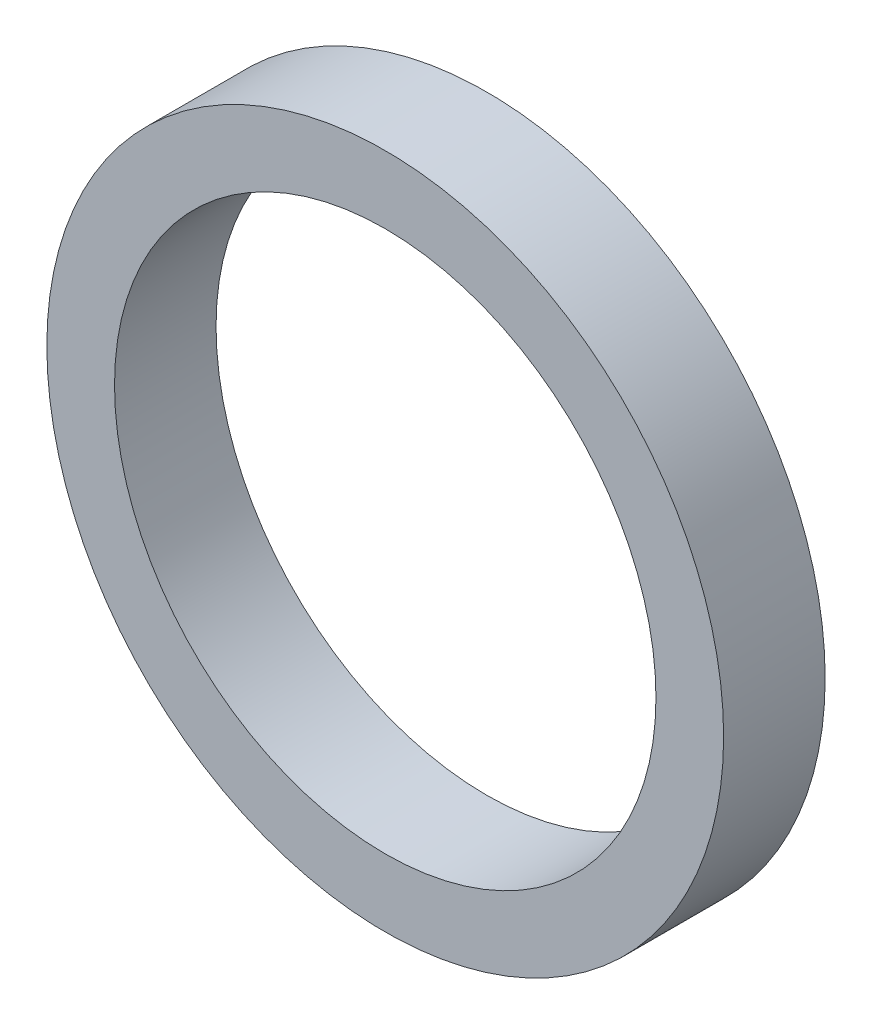
ISO-10303-21;
HEADER;
FILE_DESCRIPTION(('STEP AP214'),'2;1');
FILE_NAME('part.step','',(''),(''),'','','');
FILE_SCHEMA(('AUTOMOTIVE_DESIGN { 1 0 10303 214 1 1 1 1 }'));
ENDSEC;
DATA;
#1=APPLICATION_CONTEXT('core data for automotive mechanical design processes');
#2=APPLICATION_PROTOCOL_DEFINITION('international standard','automotive_design',2000,#1);
#3=PRODUCT_CONTEXT('',#1,'mechanical');
#4=PRODUCT('Part','Part','',(#3));
#5=PRODUCT_RELATED_PRODUCT_CATEGORY('part','',(#4));
#6=PRODUCT_DEFINITION_FORMATION('','',#4);
#7=PRODUCT_DEFINITION_CONTEXT('part definition',#1,'design');
#8=PRODUCT_DEFINITION('design','',#6,#7);
#9=PRODUCT_DEFINITION_SHAPE('','',#8);
#10=(LENGTH_UNIT() NAMED_UNIT(*) SI_UNIT(.MILLI.,.METRE.));
#11=(NAMED_UNIT(*) PLANE_ANGLE_UNIT() SI_UNIT($,.RADIAN.));
#12=(NAMED_UNIT(*) SI_UNIT($,.STERADIAN.) SOLID_ANGLE_UNIT());
#13=UNCERTAINTY_MEASURE_WITH_UNIT(LENGTH_MEASURE(1.E-05),#10,'distance_accuracy_value','');
#14=(GEOMETRIC_REPRESENTATION_CONTEXT(3) GLOBAL_UNCERTAINTY_ASSIGNED_CONTEXT((#13)) GLOBAL_UNIT_ASSIGNED_CONTEXT((#10,
#11,#12)) REPRESENTATION_CONTEXT('',''));
#15=CARTESIAN_POINT('',(0.,0.,0.));
#16=DIRECTION('',(0.,0.,1.));
#17=DIRECTION('',(1.,0.,0.));
#18=AXIS2_PLACEMENT_3D('',#15,#16,#17);
#19=CARTESIAN_POINT('',(0.,0.,3.));
#20=DIRECTION('',(0.,0.,1.));
#21=DIRECTION('',(1.,0.,0.));
#22=AXIS2_PLACEMENT_3D('',#19,#20,#21);
#23=PLANE('',#22);
#24=CARTESIAN_POINT('',(0.,0.,3.));
#25=DIRECTION('',(0.,0.,1.));
#26=DIRECTION('',(1.,0.,0.));
#27=AXIS2_PLACEMENT_3D('',#24,#25,#26);
#28=CIRCLE('',#27,10.);
#29=CARTESIAN_POINT('',(10.,0.,3.));
#30=VERTEX_POINT('',#29);
#31=EDGE_CURVE('E10',#30,#30,#28,.T.);
#32=ORIENTED_EDGE('',*,*,#31,.T.);
#33=EDGE_LOOP('',(#32));
#34=FACE_BOUND('',#33,.T.);
#35=CARTESIAN_POINT('',(0.,0.,3.));
#36=DIRECTION('',(0.,0.,1.));
#37=DIRECTION('',(1.,0.,0.));
#38=AXIS2_PLACEMENT_3D('',#35,#36,#37);
#39=CIRCLE('',#38,8.);
#40=CARTESIAN_POINT('',(8.,0.,3.));
#41=VERTEX_POINT('',#40);
#42=EDGE_CURVE('E50',#41,#41,#39,.T.);
#43=ORIENTED_EDGE('',*,*,#42,.F.);
#44=EDGE_LOOP('',(#43));
#45=FACE_BOUND('',#44,.T.);
#46=ADVANCED_FACE('F37',(#34,#45),#23,.T.);
#47=CARTESIAN_POINT('',(0.,0.,0.));
#48=DIRECTION('',(0.,0.,1.));
#49=DIRECTION('',(1.,0.,0.));
#50=AXIS2_PLACEMENT_3D('',#47,#48,#49);
#51=PLANE('',#50);
#52=CARTESIAN_POINT('',(0.,0.,0.));
#53=DIRECTION('',(0.,0.,1.));
#54=DIRECTION('',(1.,0.,0.));
#55=AXIS2_PLACEMENT_3D('',#52,#53,#54);
#56=CIRCLE('',#55,10.);
#57=CARTESIAN_POINT('',(10.,0.,0.));
#58=VERTEX_POINT('',#57);
#59=EDGE_CURVE('E41',#58,#58,#56,.T.);
#60=ORIENTED_EDGE('',*,*,#59,.F.);
#61=EDGE_LOOP('',(#60));
#62=FACE_BOUND('',#61,.T.);
#63=CARTESIAN_POINT('',(0.,0.,0.));
#64=DIRECTION('',(0.,0.,1.));
#65=DIRECTION('',(1.,0.,0.));
#66=AXIS2_PLACEMENT_3D('',#63,#64,#65);
#67=CIRCLE('',#66,8.);
#68=CARTESIAN_POINT('',(8.,0.,0.));
#69=VERTEX_POINT('',#68);
#70=EDGE_CURVE('E52',#69,#69,#67,.T.);
#71=ORIENTED_EDGE('',*,*,#70,.T.);
#72=EDGE_LOOP('',(#71));
#73=FACE_BOUND('',#72,.T.);
#74=ADVANCED_FACE('F64',(#62,#73),#51,.F.);
#75=CARTESIAN_POINT('',(0.,0.,3.));
#76=DIRECTION('',(0.,0.,-1.));
#77=DIRECTION('',(-1.,0.,0.));
#78=AXIS2_PLACEMENT_3D('',#75,#76,#77);
#79=CYLINDRICAL_SURFACE('',#78,10.);
#80=ORIENTED_EDGE('',*,*,#31,.F.);
#81=EDGE_LOOP('',(#80));
#82=FACE_BOUND('',#81,.T.);
#83=ORIENTED_EDGE('',*,*,#59,.T.);
#84=EDGE_LOOP('',(#83));
#85=FACE_BOUND('',#84,.T.);
#86=ADVANCED_FACE('F39',(#82,#85),#79,.T.);
#87=CARTESIAN_POINT('',(0.,0.,3.));
#88=DIRECTION('',(0.,0.,-1.));
#89=DIRECTION('',(-1.,0.,0.));
#90=AXIS2_PLACEMENT_3D('',#87,#88,#89);
#91=CYLINDRICAL_SURFACE('',#90,8.);
#92=ORIENTED_EDGE('',*,*,#42,.T.);
#93=EDGE_LOOP('',(#92));
#94=FACE_BOUND('',#93,.T.);
#95=ORIENTED_EDGE('',*,*,#70,.F.);
#96=EDGE_LOOP('',(#95));
#97=FACE_BOUND('',#96,.T.);
#98=ADVANCED_FACE('F60',(#94,#97),#91,.F.);
#99=CLOSED_SHELL('',(#46,#74,#86,#98));
#100=MANIFOLD_SOLID_BREP('B2',#99);
#101=ADVANCED_BREP_SHAPE_REPRESENTATION('',(#18,#100),#14);
#102=SHAPE_DEFINITION_REPRESENTATION(#9,#101);
ENDSEC;
END-ISO-10303-21;
